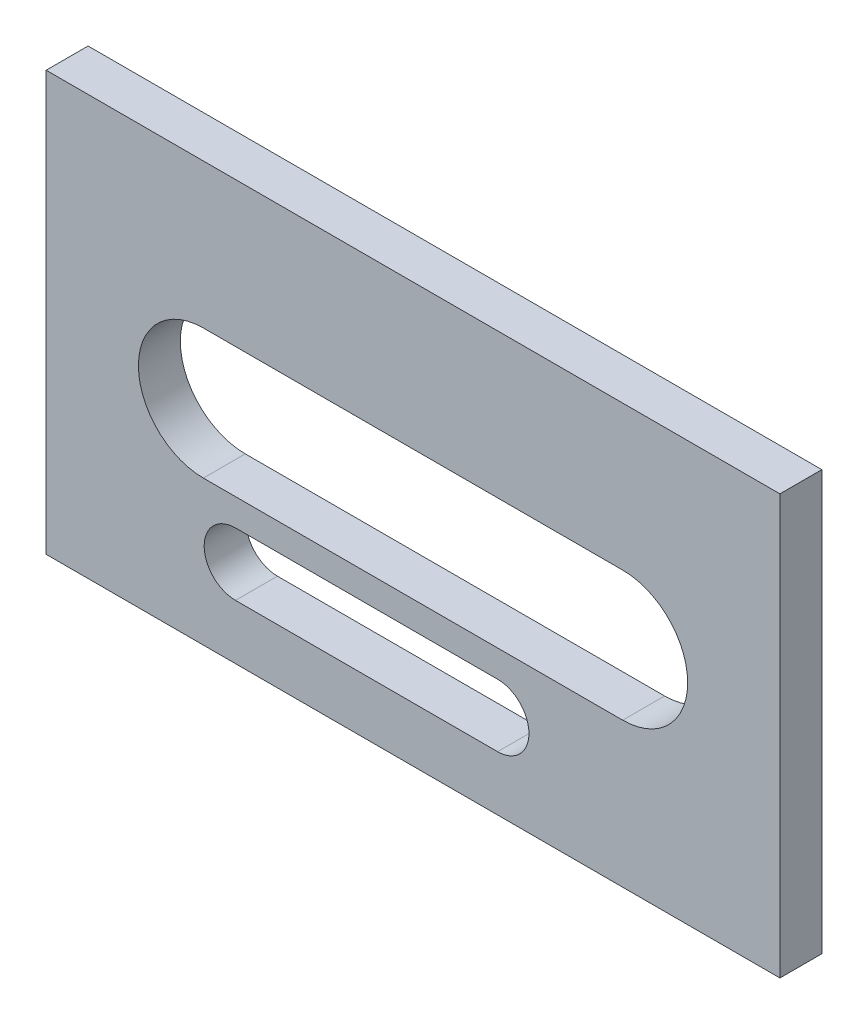
ISO-10303-21;
HEADER;
FILE_DESCRIPTION(('STEP AP214'),'2;1');
FILE_NAME('part.step','',(''),(''),'','','');
FILE_SCHEMA(('AUTOMOTIVE_DESIGN { 1 0 10303 214 1 1 1 1 }'));
ENDSEC;
DATA;
#1=APPLICATION_CONTEXT('core data for automotive mechanical design processes');
#2=APPLICATION_PROTOCOL_DEFINITION('international standard','automotive_design',2000,#1);
#3=PRODUCT_CONTEXT('',#1,'mechanical');
#4=PRODUCT('Part','Part','',(#3));
#5=PRODUCT_RELATED_PRODUCT_CATEGORY('part','',(#4));
#6=PRODUCT_DEFINITION_FORMATION('','',#4);
#7=PRODUCT_DEFINITION_CONTEXT('part definition',#1,'design');
#8=PRODUCT_DEFINITION('design','',#6,#7);
#9=PRODUCT_DEFINITION_SHAPE('','',#8);
#10=(LENGTH_UNIT() NAMED_UNIT(*) SI_UNIT(.MILLI.,.METRE.));
#11=(NAMED_UNIT(*) PLANE_ANGLE_UNIT() SI_UNIT($,.RADIAN.));
#12=(NAMED_UNIT(*) SI_UNIT($,.STERADIAN.) SOLID_ANGLE_UNIT());
#13=UNCERTAINTY_MEASURE_WITH_UNIT(LENGTH_MEASURE(1.E-05),#10,'distance_accuracy_value','');
#14=(GEOMETRIC_REPRESENTATION_CONTEXT(3) GLOBAL_UNCERTAINTY_ASSIGNED_CONTEXT((#13)) GLOBAL_UNIT_ASSIGNED_CONTEXT((#10,
#11,#12)) REPRESENTATION_CONTEXT('',''));
#15=CARTESIAN_POINT('',(0.,0.,0.));
#16=DIRECTION('',(0.,0.,1.));
#17=DIRECTION('',(1.,0.,0.));
#18=AXIS2_PLACEMENT_3D('',#15,#16,#17);
#19=CARTESIAN_POINT('',(0.,0.,8.));
#20=DIRECTION('',(0.,0.,1.));
#21=DIRECTION('',(1.,0.,0.));
#22=AXIS2_PLACEMENT_3D('',#19,#20,#21);
#23=PLANE('',#22);
#24=DIRECTION('',(0.,1.,0.));
#25=VECTOR('',#24,1.);
#26=CARTESIAN_POINT('',(-83.6011867053872,96.4894009813945,8.));
#27=LINE('',#26,#25);
#28=CARTESIAN_POINT('',(-83.6011867053872,16.4894009813945,8.));
#29=VERTEX_POINT('',#28);
#30=CARTESIAN_POINT('',(-83.6011867053872,96.4894009813945,8.));
#31=VERTEX_POINT('',#30);
#32=EDGE_CURVE('E189',#29,#31,#27,.T.);
#33=ORIENTED_EDGE('',*,*,#32,.T.);
#34=DIRECTION('',(-1.,0.,0.));
#35=VECTOR('',#34,1.);
#36=CARTESIAN_POINT('',(-223.601186705387,96.4894009813945,8.));
#37=LINE('',#36,#35);
#38=CARTESIAN_POINT('',(-223.601186705387,96.4894009813945,8.));
#39=VERTEX_POINT('',#38);
#40=EDGE_CURVE('E192',#31,#39,#37,.T.);
#41=ORIENTED_EDGE('',*,*,#40,.T.);
#42=DIRECTION('',(0.,-1.,0.));
#43=VECTOR('',#42,1.);
#44=CARTESIAN_POINT('',(-223.601186705387,96.4894009813945,8.));
#45=LINE('',#44,#43);
#46=CARTESIAN_POINT('',(-223.601186705387,16.4894009813945,8.));
#47=VERTEX_POINT('',#46);
#48=EDGE_CURVE('E195',#39,#47,#45,.T.);
#49=ORIENTED_EDGE('',*,*,#48,.T.);
#50=DIRECTION('',(1.,0.,0.));
#51=VECTOR('',#50,1.);
#52=CARTESIAN_POINT('',(-223.601186705387,16.4894009813945,8.));
#53=LINE('',#52,#51);
#54=EDGE_CURVE('E197',#47,#29,#53,.T.);
#55=ORIENTED_EDGE('',*,*,#54,.T.);
#56=EDGE_LOOP('',(#33,#41,#49,#55));
#57=FACE_BOUND('',#56,.T.);
#58=DIRECTION('',(1.,0.,0.));
#59=VECTOR('',#58,1.);
#60=CARTESIAN_POINT('',(-193.601186705387,44.0913657870521,8.));
#61=LINE('',#60,#59);
#62=CARTESIAN_POINT('',(-193.601186705387,44.0913657870521,8.));
#63=VERTEX_POINT('',#62);
#64=CARTESIAN_POINT('',(-113.601186705387,44.0913657870522,8.));
#65=VERTEX_POINT('',#64);
#66=EDGE_CURVE('E160',#63,#65,#61,.T.);
#67=ORIENTED_EDGE('',*,*,#66,.F.);
#68=CARTESIAN_POINT('',(-193.601186705387,56.4894009813945,8.));
#69=DIRECTION('',(0.,0.,1.));
#70=DIRECTION('',(1.,0.,0.));
#71=AXIS2_PLACEMENT_3D('',#68,#69,#70);
#72=CIRCLE('',#71,12.3980351943423);
#73=CARTESIAN_POINT('',(-193.601186705387,68.8874361757368,8.));
#74=VERTEX_POINT('',#73);
#75=EDGE_CURVE('E158',#74,#63,#72,.T.);
#76=ORIENTED_EDGE('',*,*,#75,.F.);
#77=DIRECTION('',(-1.,0.,0.));
#78=VECTOR('',#77,1.);
#79=CARTESIAN_POINT('',(-193.601186705387,68.8874361757368,8.));
#80=LINE('',#79,#78);
#81=CARTESIAN_POINT('',(-113.601186705387,68.8874361757368,8.));
#82=VERTEX_POINT('',#81);
#83=EDGE_CURVE('E166',#82,#74,#80,.T.);
#84=ORIENTED_EDGE('',*,*,#83,.F.);
#85=CARTESIAN_POINT('',(-113.601186705387,56.4894009813945,8.));
#86=DIRECTION('',(0.,0.,1.));
#87=DIRECTION('',(1.,0.,0.));
#88=AXIS2_PLACEMENT_3D('',#85,#86,#87);
#89=CIRCLE('',#88,12.3980351943423);
#90=EDGE_CURVE('E163',#65,#82,#89,.T.);
#91=ORIENTED_EDGE('',*,*,#90,.F.);
#92=EDGE_LOOP('',(#67,#76,#84,#91));
#93=FACE_BOUND('',#92,.T.);
#94=DIRECTION('',(1.,0.,0.));
#95=VECTOR('',#94,1.);
#96=CARTESIAN_POINT('',(-187.470030447294,26.9532225105825,8.));
#97=LINE('',#96,#95);
#98=CARTESIAN_POINT('',(-187.470030447294,26.9532225105825,8.));
#99=VERTEX_POINT('',#98);
#100=CARTESIAN_POINT('',(-137.470030447294,26.9532225105825,8.));
#101=VERTEX_POINT('',#100);
#102=EDGE_CURVE('E130',#99,#101,#97,.T.);
#103=ORIENTED_EDGE('',*,*,#102,.F.);
#104=CARTESIAN_POINT('',(-187.470030447294,32.9379709563338,8.));
#105=DIRECTION('',(0.,0.,1.));
#106=DIRECTION('',(1.,0.,0.));
#107=AXIS2_PLACEMENT_3D('',#104,#105,#106);
#108=CIRCLE('',#107,5.98474844575131);
#109=CARTESIAN_POINT('',(-187.470030447294,38.9227194020851,8.));
#110=VERTEX_POINT('',#109);
#111=EDGE_CURVE('E122',#110,#99,#108,.T.);
#112=ORIENTED_EDGE('',*,*,#111,.F.);
#113=DIRECTION('',(-1.,0.,0.));
#114=VECTOR('',#113,1.);
#115=CARTESIAN_POINT('',(-187.470030447294,38.9227194020851,8.));
#116=LINE('',#115,#114);
#117=CARTESIAN_POINT('',(-137.470030447294,38.9227194020851,8.));
#118=VERTEX_POINT('',#117);
#119=EDGE_CURVE('E144',#118,#110,#116,.T.);
#120=ORIENTED_EDGE('',*,*,#119,.F.);
#121=CARTESIAN_POINT('',(-137.470030447294,32.9379709563338,8.));
#122=DIRECTION('',(0.,0.,1.));
#123=DIRECTION('',(1.,0.,0.));
#124=AXIS2_PLACEMENT_3D('',#121,#122,#123);
#125=CIRCLE('',#124,5.98474844575131);
#126=EDGE_CURVE('E142',#101,#118,#125,.T.);
#127=ORIENTED_EDGE('',*,*,#126,.F.);
#128=EDGE_LOOP('',(#103,#112,#120,#127));
#129=FACE_BOUND('',#128,.T.);
#130=ADVANCED_FACE('F33',(#57,#93,#129),#23,.T.);
#131=CARTESIAN_POINT('',(0.,0.,0.));
#132=DIRECTION('',(0.,0.,1.));
#133=DIRECTION('',(1.,0.,0.));
#134=AXIS2_PLACEMENT_3D('',#131,#132,#133);
#135=PLANE('',#134);
#136=CARTESIAN_POINT('',(-193.601186705387,56.4894009813945,0.));
#137=DIRECTION('',(0.,0.,1.));
#138=DIRECTION('',(1.,0.,0.));
#139=AXIS2_PLACEMENT_3D('',#136,#137,#138);
#140=CIRCLE('',#139,12.3980351943423);
#141=CARTESIAN_POINT('',(-193.601186705387,68.8874361757368,0.));
#142=VERTEX_POINT('',#141);
#143=CARTESIAN_POINT('',(-193.601186705387,44.0913657870521,0.));
#144=VERTEX_POINT('',#143);
#145=EDGE_CURVE('E138',#142,#144,#140,.T.);
#146=ORIENTED_EDGE('',*,*,#145,.T.);
#147=DIRECTION('',(1.,0.,0.));
#148=VECTOR('',#147,1.);
#149=CARTESIAN_POINT('',(-193.601186705387,44.0913657870521,0.));
#150=LINE('',#149,#148);
#151=CARTESIAN_POINT('',(-113.601186705387,44.0913657870522,0.));
#152=VERTEX_POINT('',#151);
#153=EDGE_CURVE('E171',#144,#152,#150,.T.);
#154=ORIENTED_EDGE('',*,*,#153,.T.);
#155=CARTESIAN_POINT('',(-113.601186705387,56.4894009813945,0.));
#156=DIRECTION('',(0.,0.,1.));
#157=DIRECTION('',(1.,0.,0.));
#158=AXIS2_PLACEMENT_3D('',#155,#156,#157);
#159=CIRCLE('',#158,12.3980351943423);
#160=CARTESIAN_POINT('',(-113.601186705387,68.8874361757368,0.));
#161=VERTEX_POINT('',#160);
#162=EDGE_CURVE('E174',#152,#161,#159,.T.);
#163=ORIENTED_EDGE('',*,*,#162,.T.);
#164=DIRECTION('',(-1.,0.,0.));
#165=VECTOR('',#164,1.);
#166=CARTESIAN_POINT('',(-193.601186705387,68.8874361757368,0.));
#167=LINE('',#166,#165);
#168=EDGE_CURVE('E161',#161,#142,#167,.T.);
#169=ORIENTED_EDGE('',*,*,#168,.T.);
#170=EDGE_LOOP('',(#146,#154,#163,#169));
#171=FACE_BOUND('',#170,.T.);
#172=DIRECTION('',(0.,1.,0.));
#173=VECTOR('',#172,1.);
#174=CARTESIAN_POINT('',(-83.6011867053872,96.4894009813945,0.));
#175=LINE('',#174,#173);
#176=CARTESIAN_POINT('',(-83.6011867053872,16.4894009813945,0.));
#177=VERTEX_POINT('',#176);
#178=CARTESIAN_POINT('',(-83.6011867053872,96.4894009813945,0.));
#179=VERTEX_POINT('',#178);
#180=EDGE_CURVE('E188',#177,#179,#175,.T.);
#181=ORIENTED_EDGE('',*,*,#180,.F.);
#182=DIRECTION('',(1.,0.,0.));
#183=VECTOR('',#182,1.);
#184=CARTESIAN_POINT('',(-223.601186705387,16.4894009813945,0.));
#185=LINE('',#184,#183);
#186=CARTESIAN_POINT('',(-223.601186705387,16.4894009813945,0.));
#187=VERTEX_POINT('',#186);
#188=EDGE_CURVE('E193',#187,#177,#185,.T.);
#189=ORIENTED_EDGE('',*,*,#188,.F.);
#190=DIRECTION('',(0.,-1.,0.));
#191=VECTOR('',#190,1.);
#192=CARTESIAN_POINT('',(-223.601186705387,96.4894009813945,0.));
#193=LINE('',#192,#191);
#194=CARTESIAN_POINT('',(-223.601186705387,96.4894009813945,0.));
#195=VERTEX_POINT('',#194);
#196=EDGE_CURVE('E204',#195,#187,#193,.T.);
#197=ORIENTED_EDGE('',*,*,#196,.F.);
#198=DIRECTION('',(-1.,0.,0.));
#199=VECTOR('',#198,1.);
#200=CARTESIAN_POINT('',(-223.601186705387,96.4894009813945,0.));
#201=LINE('',#200,#199);
#202=EDGE_CURVE('E202',#179,#195,#201,.T.);
#203=ORIENTED_EDGE('',*,*,#202,.F.);
#204=EDGE_LOOP('',(#181,#189,#197,#203));
#205=FACE_BOUND('',#204,.T.);
#206=CARTESIAN_POINT('',(-187.470030447294,32.9379709563338,0.));
#207=DIRECTION('',(0.,0.,1.));
#208=DIRECTION('',(1.,0.,0.));
#209=AXIS2_PLACEMENT_3D('',#206,#207,#208);
#210=CIRCLE('',#209,5.98474844575131);
#211=CARTESIAN_POINT('',(-187.470030447294,38.9227194020851,0.));
#212=VERTEX_POINT('',#211);
#213=CARTESIAN_POINT('',(-187.470030447294,26.9532225105825,0.));
#214=VERTEX_POINT('',#213);
#215=EDGE_CURVE('E56',#212,#214,#210,.T.);
#216=ORIENTED_EDGE('',*,*,#215,.T.);
#217=DIRECTION('',(1.,0.,0.));
#218=VECTOR('',#217,1.);
#219=CARTESIAN_POINT('',(-187.470030447294,26.9532225105825,0.));
#220=LINE('',#219,#218);
#221=CARTESIAN_POINT('',(-137.470030447294,26.9532225105825,0.));
#222=VERTEX_POINT('',#221);
#223=EDGE_CURVE('E137',#214,#222,#220,.T.);
#224=ORIENTED_EDGE('',*,*,#223,.T.);
#225=CARTESIAN_POINT('',(-137.470030447294,32.9379709563338,0.));
#226=DIRECTION('',(0.,0.,1.));
#227=DIRECTION('',(1.,0.,0.));
#228=AXIS2_PLACEMENT_3D('',#225,#226,#227);
#229=CIRCLE('',#228,5.98474844575131);
#230=CARTESIAN_POINT('',(-137.470030447294,38.9227194020851,0.));
#231=VERTEX_POINT('',#230);
#232=EDGE_CURVE('E150',#222,#231,#229,.T.);
#233=ORIENTED_EDGE('',*,*,#232,.T.);
#234=DIRECTION('',(-1.,0.,0.));
#235=VECTOR('',#234,1.);
#236=CARTESIAN_POINT('',(-187.470030447294,38.9227194020851,0.));
#237=LINE('',#236,#235);
#238=EDGE_CURVE('E131',#231,#212,#237,.T.);
#239=ORIENTED_EDGE('',*,*,#238,.T.);
#240=EDGE_LOOP('',(#216,#224,#233,#239));
#241=FACE_BOUND('',#240,.T.);
#242=ADVANCED_FACE('F222',(#171,#205,#241),#135,.F.);
#243=CARTESIAN_POINT('',(-83.6011867053872,96.4894009813945,8.));
#244=DIRECTION('',(-1.,0.,0.));
#245=DIRECTION('',(0.,0.,1.));
#246=AXIS2_PLACEMENT_3D('',#243,#244,#245);
#247=PLANE('',#246);
#248=ORIENTED_EDGE('',*,*,#180,.T.);
#249=DIRECTION('',(0.,0.,-1.));
#250=VECTOR('',#249,1.);
#251=CARTESIAN_POINT('',(-83.6011867053872,96.4894009813945,8.));
#252=LINE('',#251,#250);
#253=EDGE_CURVE('E11',#31,#179,#252,.T.);
#254=ORIENTED_EDGE('',*,*,#253,.F.);
#255=ORIENTED_EDGE('',*,*,#32,.F.);
#256=DIRECTION('',(0.,0.,-1.));
#257=VECTOR('',#256,1.);
#258=CARTESIAN_POINT('',(-83.6011867053872,16.4894009813945,8.));
#259=LINE('',#258,#257);
#260=EDGE_CURVE('E199',#29,#177,#259,.T.);
#261=ORIENTED_EDGE('',*,*,#260,.T.);
#262=EDGE_LOOP('',(#248,#254,#255,#261));
#263=FACE_BOUND('',#262,.T.);
#264=ADVANCED_FACE('F35',(#263),#247,.F.);
#265=CARTESIAN_POINT('',(-223.601186705387,96.4894009813945,8.));
#266=DIRECTION('',(0.,-1.,0.));
#267=DIRECTION('',(0.,0.,-1.));
#268=AXIS2_PLACEMENT_3D('',#265,#266,#267);
#269=PLANE('',#268);
#270=ORIENTED_EDGE('',*,*,#202,.T.);
#271=DIRECTION('',(0.,0.,-1.));
#272=VECTOR('',#271,1.);
#273=CARTESIAN_POINT('',(-223.601186705387,96.4894009813945,8.));
#274=LINE('',#273,#272);
#275=EDGE_CURVE('E41',#39,#195,#274,.T.);
#276=ORIENTED_EDGE('',*,*,#275,.F.);
#277=ORIENTED_EDGE('',*,*,#40,.F.);
#278=ORIENTED_EDGE('',*,*,#253,.T.);
#279=EDGE_LOOP('',(#270,#276,#277,#278));
#280=FACE_BOUND('',#279,.T.);
#281=ADVANCED_FACE('F233',(#280),#269,.F.);
#282=CARTESIAN_POINT('',(-223.601186705387,96.4894009813945,8.));
#283=DIRECTION('',(1.,0.,0.));
#284=DIRECTION('',(0.,0.,-1.));
#285=AXIS2_PLACEMENT_3D('',#282,#283,#284);
#286=PLANE('',#285);
#287=ORIENTED_EDGE('',*,*,#196,.T.);
#288=DIRECTION('',(0.,0.,-1.));
#289=VECTOR('',#288,1.);
#290=CARTESIAN_POINT('',(-223.601186705387,16.4894009813945,8.));
#291=LINE('',#290,#289);
#292=EDGE_CURVE('E209',#47,#187,#291,.T.);
#293=ORIENTED_EDGE('',*,*,#292,.F.);
#294=ORIENTED_EDGE('',*,*,#48,.F.);
#295=ORIENTED_EDGE('',*,*,#275,.T.);
#296=EDGE_LOOP('',(#287,#293,#294,#295));
#297=FACE_BOUND('',#296,.T.);
#298=ADVANCED_FACE('F216',(#297),#286,.F.);
#299=CARTESIAN_POINT('',(-223.601186705387,16.4894009813945,8.));
#300=DIRECTION('',(0.,1.,0.));
#301=DIRECTION('',(0.,0.,1.));
#302=AXIS2_PLACEMENT_3D('',#299,#300,#301);
#303=PLANE('',#302);
#304=ORIENTED_EDGE('',*,*,#188,.T.);
#305=ORIENTED_EDGE('',*,*,#260,.F.);
#306=ORIENTED_EDGE('',*,*,#54,.F.);
#307=ORIENTED_EDGE('',*,*,#292,.T.);
#308=EDGE_LOOP('',(#304,#305,#306,#307));
#309=FACE_BOUND('',#308,.T.);
#310=ADVANCED_FACE('F226',(#309),#303,.F.);
#311=CARTESIAN_POINT('',(-193.601186705387,56.4894009813945,8.));
#312=DIRECTION('',(0.,0.,-1.));
#313=DIRECTION('',(-1.,0.,0.));
#314=AXIS2_PLACEMENT_3D('',#311,#312,#313);
#315=CYLINDRICAL_SURFACE('',#314,12.3980351943423);
#316=ORIENTED_EDGE('',*,*,#145,.F.);
#317=DIRECTION('',(0.,0.,-1.));
#318=VECTOR('',#317,1.);
#319=CARTESIAN_POINT('',(-193.601186705387,68.8874361757368,8.));
#320=LINE('',#319,#318);
#321=EDGE_CURVE('E168',#74,#142,#320,.T.);
#322=ORIENTED_EDGE('',*,*,#321,.F.);
#323=ORIENTED_EDGE('',*,*,#75,.T.);
#324=DIRECTION('',(0.,0.,-1.));
#325=VECTOR('',#324,1.);
#326=CARTESIAN_POINT('',(-193.601186705387,44.0913657870521,8.));
#327=LINE('',#326,#325);
#328=EDGE_CURVE('E185',#63,#144,#327,.T.);
#329=ORIENTED_EDGE('',*,*,#328,.T.);
#330=EDGE_LOOP('',(#316,#322,#323,#329));
#331=FACE_BOUND('',#330,.T.);
#332=ADVANCED_FACE('F248',(#331),#315,.F.);
#333=CARTESIAN_POINT('',(-193.601186705387,44.0913657870521,8.));
#334=DIRECTION('',(0.,1.,0.));
#335=DIRECTION('',(-1.,0.,0.));
#336=AXIS2_PLACEMENT_3D('',#333,#334,#335);
#337=PLANE('',#336);
#338=ORIENTED_EDGE('',*,*,#153,.F.);
#339=ORIENTED_EDGE('',*,*,#328,.F.);
#340=ORIENTED_EDGE('',*,*,#66,.T.);
#341=DIRECTION('',(0.,0.,-1.));
#342=VECTOR('',#341,1.);
#343=CARTESIAN_POINT('',(-113.601186705387,44.0913657870522,8.));
#344=LINE('',#343,#342);
#345=EDGE_CURVE('E183',#65,#152,#344,.T.);
#346=ORIENTED_EDGE('',*,*,#345,.T.);
#347=EDGE_LOOP('',(#338,#339,#340,#346));
#348=FACE_BOUND('',#347,.T.);
#349=ADVANCED_FACE('F255',(#348),#337,.T.);
#350=CARTESIAN_POINT('',(-113.601186705387,56.4894009813945,8.));
#351=DIRECTION('',(0.,0.,-1.));
#352=DIRECTION('',(-1.,0.,0.));
#353=AXIS2_PLACEMENT_3D('',#350,#351,#352);
#354=CYLINDRICAL_SURFACE('',#353,12.3980351943423);
#355=ORIENTED_EDGE('',*,*,#162,.F.);
#356=ORIENTED_EDGE('',*,*,#345,.F.);
#357=ORIENTED_EDGE('',*,*,#90,.T.);
#358=DIRECTION('',(0.,0.,-1.));
#359=VECTOR('',#358,1.);
#360=CARTESIAN_POINT('',(-113.601186705387,68.8874361757368,8.));
#361=LINE('',#360,#359);
#362=EDGE_CURVE('E181',#82,#161,#361,.T.);
#363=ORIENTED_EDGE('',*,*,#362,.T.);
#364=EDGE_LOOP('',(#355,#356,#357,#363));
#365=FACE_BOUND('',#364,.T.);
#366=ADVANCED_FACE('F260',(#365),#354,.F.);
#367=CARTESIAN_POINT('',(-193.601186705387,68.8874361757368,8.));
#368=DIRECTION('',(0.,-1.,0.));
#369=DIRECTION('',(1.,0.,0.));
#370=AXIS2_PLACEMENT_3D('',#367,#368,#369);
#371=PLANE('',#370);
#372=ORIENTED_EDGE('',*,*,#168,.F.);
#373=ORIENTED_EDGE('',*,*,#362,.F.);
#374=ORIENTED_EDGE('',*,*,#83,.T.);
#375=ORIENTED_EDGE('',*,*,#321,.T.);
#376=EDGE_LOOP('',(#372,#373,#374,#375));
#377=FACE_BOUND('',#376,.T.);
#378=ADVANCED_FACE('F267',(#377),#371,.T.);
#379=CARTESIAN_POINT('',(-187.470030447294,32.9379709563338,8.));
#380=DIRECTION('',(0.,0.,-1.));
#381=DIRECTION('',(-1.,0.,0.));
#382=AXIS2_PLACEMENT_3D('',#379,#380,#381);
#383=CYLINDRICAL_SURFACE('',#382,5.98474844575131);
#384=ORIENTED_EDGE('',*,*,#215,.F.);
#385=DIRECTION('',(0.,0.,-1.));
#386=VECTOR('',#385,1.);
#387=CARTESIAN_POINT('',(-187.470030447294,38.9227194020851,8.));
#388=LINE('',#387,#386);
#389=EDGE_CURVE('E126',#110,#212,#388,.T.);
#390=ORIENTED_EDGE('',*,*,#389,.F.);
#391=ORIENTED_EDGE('',*,*,#111,.T.);
#392=DIRECTION('',(0.,0.,-1.));
#393=VECTOR('',#392,1.);
#394=CARTESIAN_POINT('',(-187.470030447294,26.9532225105825,8.));
#395=LINE('',#394,#393);
#396=EDGE_CURVE('E125',#99,#214,#395,.T.);
#397=ORIENTED_EDGE('',*,*,#396,.T.);
#398=EDGE_LOOP('',(#384,#390,#391,#397));
#399=FACE_BOUND('',#398,.T.);
#400=ADVANCED_FACE('F124',(#399),#383,.F.);
#401=CARTESIAN_POINT('',(-187.470030447294,26.9532225105825,8.));
#402=DIRECTION('',(0.,1.,0.));
#403=DIRECTION('',(0.,0.,1.));
#404=AXIS2_PLACEMENT_3D('',#401,#402,#403);
#405=PLANE('',#404);
#406=ORIENTED_EDGE('',*,*,#223,.F.);
#407=ORIENTED_EDGE('',*,*,#396,.F.);
#408=ORIENTED_EDGE('',*,*,#102,.T.);
#409=DIRECTION('',(0.,0.,-1.));
#410=VECTOR('',#409,1.);
#411=CARTESIAN_POINT('',(-137.470030447294,26.9532225105825,8.));
#412=LINE('',#411,#410);
#413=EDGE_CURVE('E139',#101,#222,#412,.T.);
#414=ORIENTED_EDGE('',*,*,#413,.T.);
#415=EDGE_LOOP('',(#406,#407,#408,#414));
#416=FACE_BOUND('',#415,.T.);
#417=ADVANCED_FACE('F134',(#416),#405,.T.);
#418=CARTESIAN_POINT('',(-137.470030447294,32.9379709563338,8.));
#419=DIRECTION('',(0.,0.,-1.));
#420=DIRECTION('',(-1.,0.,0.));
#421=AXIS2_PLACEMENT_3D('',#418,#419,#420);
#422=CYLINDRICAL_SURFACE('',#421,5.98474844575131);
#423=ORIENTED_EDGE('',*,*,#232,.F.);
#424=ORIENTED_EDGE('',*,*,#413,.F.);
#425=ORIENTED_EDGE('',*,*,#126,.T.);
#426=DIRECTION('',(0.,0.,-1.));
#427=VECTOR('',#426,1.);
#428=CARTESIAN_POINT('',(-137.470030447294,38.9227194020851,8.));
#429=LINE('',#428,#427);
#430=EDGE_CURVE('E48',#118,#231,#429,.T.);
#431=ORIENTED_EDGE('',*,*,#430,.T.);
#432=EDGE_LOOP('',(#423,#424,#425,#431));
#433=FACE_BOUND('',#432,.T.);
#434=ADVANCED_FACE('F285',(#433),#422,.F.);
#435=CARTESIAN_POINT('',(-187.470030447294,38.9227194020851,8.));
#436=DIRECTION('',(0.,-1.,0.));
#437=DIRECTION('',(0.,0.,-1.));
#438=AXIS2_PLACEMENT_3D('',#435,#436,#437);
#439=PLANE('',#438);
#440=ORIENTED_EDGE('',*,*,#238,.F.);
#441=ORIENTED_EDGE('',*,*,#430,.F.);
#442=ORIENTED_EDGE('',*,*,#119,.T.);
#443=ORIENTED_EDGE('',*,*,#389,.T.);
#444=EDGE_LOOP('',(#440,#441,#442,#443));
#445=FACE_BOUND('',#444,.T.);
#446=ADVANCED_FACE('F288',(#445),#439,.T.);
#447=CLOSED_SHELL('',(#130,#242,#264,#281,#298,#310,#332,#349,#366,#378,#400,#417,#434,#446));
#448=MANIFOLD_SOLID_BREP('B2',#447);
#449=ADVANCED_BREP_SHAPE_REPRESENTATION('',(#18,#448),#14);
#450=SHAPE_DEFINITION_REPRESENTATION(#9,#449);
ENDSEC;
END-ISO-10303-21;
